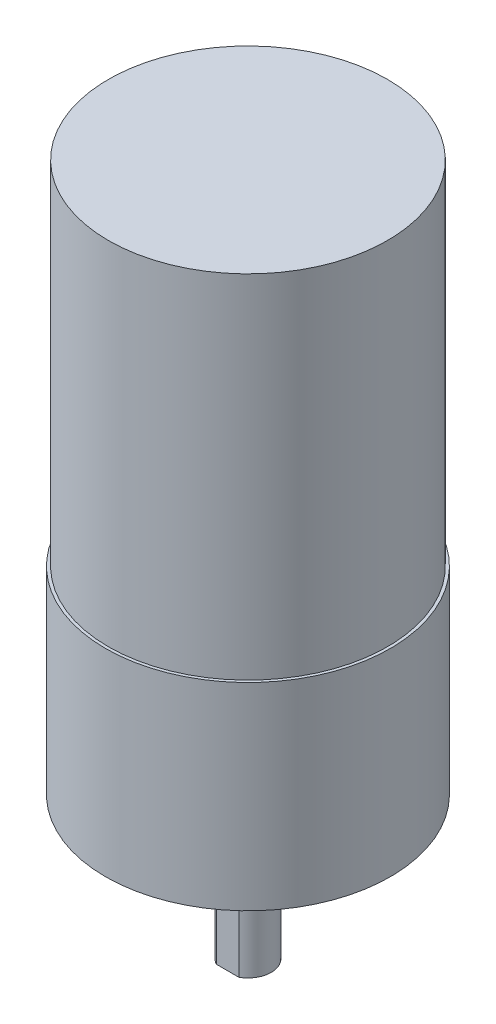
ISO-10303-21;
HEADER;
FILE_DESCRIPTION(('STEP AP214'),'2;1');
FILE_NAME('part.step','',(''),(''),'','','');
FILE_SCHEMA(('AUTOMOTIVE_DESIGN { 1 0 10303 214 1 1 1 1 }'));
ENDSEC;
DATA;
#1=APPLICATION_CONTEXT('core data for automotive mechanical design processes');
#2=APPLICATION_PROTOCOL_DEFINITION('international standard','automotive_design',2000,#1);
#3=PRODUCT_CONTEXT('',#1,'mechanical');
#4=PRODUCT('Part','Part','',(#3));
#5=PRODUCT_RELATED_PRODUCT_CATEGORY('part','',(#4));
#6=PRODUCT_DEFINITION_FORMATION('','',#4);
#7=PRODUCT_DEFINITION_CONTEXT('part definition',#1,'design');
#8=PRODUCT_DEFINITION('design','',#6,#7);
#9=PRODUCT_DEFINITION_SHAPE('','',#8);
#10=(LENGTH_UNIT() NAMED_UNIT(*) SI_UNIT(.MILLI.,.METRE.));
#11=(NAMED_UNIT(*) PLANE_ANGLE_UNIT() SI_UNIT($,.RADIAN.));
#12=(NAMED_UNIT(*) SI_UNIT($,.STERADIAN.) SOLID_ANGLE_UNIT());
#13=UNCERTAINTY_MEASURE_WITH_UNIT(LENGTH_MEASURE(1.E-05),#10,'distance_accuracy_value','');
#14=(GEOMETRIC_REPRESENTATION_CONTEXT(3) GLOBAL_UNCERTAINTY_ASSIGNED_CONTEXT((#13)) GLOBAL_UNIT_ASSIGNED_CONTEXT((#10,
#11,#12)) REPRESENTATION_CONTEXT('',''));
#15=CARTESIAN_POINT('',(0.,0.,0.));
#16=DIRECTION('',(0.,0.,1.));
#17=DIRECTION('',(1.,0.,0.));
#18=AXIS2_PLACEMENT_3D('',#15,#16,#17);
#19=CARTESIAN_POINT('',(0.,-12.446,0.));
#20=DIRECTION('',(0.,1.,0.));
#21=DIRECTION('',(0.,0.,1.));
#22=AXIS2_PLACEMENT_3D('',#19,#20,#21);
#23=CYLINDRICAL_SURFACE('',#22,2.032);
#24=CARTESIAN_POINT('',(0.,-12.446,0.));
#25=DIRECTION('',(0.,-1.,0.));
#26=DIRECTION('',(0.,0.,-1.));
#27=AXIS2_PLACEMENT_3D('',#24,#25,#26);
#28=CIRCLE('',#27,2.032);
#29=CARTESIAN_POINT('',(-0.983737769936686,-12.446,1.778));
#30=VERTEX_POINT('',#29);
#31=CARTESIAN_POINT('',(-0.983737769936686,-12.446,-1.778));
#32=VERTEX_POINT('',#31);
#33=EDGE_CURVE('E90',#30,#32,#28,.T.);
#34=ORIENTED_EDGE('',*,*,#33,.F.);
#35=DIRECTION('',(0.,1.,0.));
#36=VECTOR('',#35,1.);
#37=CARTESIAN_POINT('',(-0.983737769936686,-12.446,1.778));
#38=LINE('',#37,#36);
#39=CARTESIAN_POINT('',(-0.983737769936686,-2.54,1.778));
#40=VERTEX_POINT('',#39);
#41=EDGE_CURVE('E54',#30,#40,#38,.T.);
#42=ORIENTED_EDGE('',*,*,#41,.T.);
#43=CARTESIAN_POINT('',(0.,-2.54,0.));
#44=DIRECTION('',(0.,-1.,0.));
#45=DIRECTION('',(0.,0.,-1.));
#46=AXIS2_PLACEMENT_3D('',#43,#44,#45);
#47=CIRCLE('',#46,2.032);
#48=CARTESIAN_POINT('',(-0.983737769936686,-2.54,-1.778));
#49=VERTEX_POINT('',#48);
#50=EDGE_CURVE('E92',#40,#49,#47,.T.);
#51=ORIENTED_EDGE('',*,*,#50,.T.);
#52=DIRECTION('',(0.,1.,0.));
#53=VECTOR('',#52,1.);
#54=CARTESIAN_POINT('',(-0.983737769936686,-12.446,-1.778));
#55=LINE('',#54,#53);
#56=EDGE_CURVE('E79',#49,#32,#55,.F.);
#57=ORIENTED_EDGE('',*,*,#56,.T.);
#58=EDGE_LOOP('',(#34,#42,#51,#57));
#59=FACE_BOUND('',#58,.T.);
#60=ADVANCED_FACE('F39',(#59),#23,.T.);
#61=CARTESIAN_POINT('',(0.,17.272,0.));
#62=DIRECTION('',(0.,1.,0.));
#63=DIRECTION('',(0.,0.,1.));
#64=AXIS2_PLACEMENT_3D('',#61,#62,#63);
#65=PLANE('',#64);
#66=CARTESIAN_POINT('',(0.,17.272,0.));
#67=DIRECTION('',(0.,1.,0.));
#68=DIRECTION('',(0.,0.,1.));
#69=AXIS2_PLACEMENT_3D('',#66,#67,#68);
#70=CIRCLE('',#69,12.192);
#71=CARTESIAN_POINT('',(0.,17.272,12.192));
#72=VERTEX_POINT('',#71);
#73=EDGE_CURVE('E109',#72,#72,#70,.T.);
#74=ORIENTED_EDGE('',*,*,#73,.F.);
#75=EDGE_LOOP('',(#74));
#76=FACE_BOUND('',#75,.T.);
#77=CARTESIAN_POINT('',(0.,17.272,0.));
#78=DIRECTION('',(0.,1.,0.));
#79=DIRECTION('',(0.,0.,1.));
#80=AXIS2_PLACEMENT_3D('',#77,#78,#79);
#81=CIRCLE('',#80,12.446);
#82=CARTESIAN_POINT('',(0.,17.272,12.446));
#83=VERTEX_POINT('',#82);
#84=EDGE_CURVE('E125',#83,#83,#81,.T.);
#85=ORIENTED_EDGE('',*,*,#84,.T.);
#86=EDGE_LOOP('',(#85));
#87=FACE_BOUND('',#86,.T.);
#88=ADVANCED_FACE('F177',(#76,#87),#65,.T.);
#89=CARTESIAN_POINT('',(0.,0.,0.));
#90=DIRECTION('',(0.,1.,0.));
#91=DIRECTION('',(0.,0.,1.));
#92=AXIS2_PLACEMENT_3D('',#89,#90,#91);
#93=PLANE('',#92);
#94=CARTESIAN_POINT('',(0.,0.,0.));
#95=DIRECTION('',(0.,1.,0.));
#96=DIRECTION('',(0.,0.,1.));
#97=AXIS2_PLACEMENT_3D('',#94,#95,#96);
#98=CIRCLE('',#97,3.556);
#99=CARTESIAN_POINT('',(0.,0.,3.556));
#100=VERTEX_POINT('',#99);
#101=EDGE_CURVE('E102',#100,#100,#98,.T.);
#102=ORIENTED_EDGE('',*,*,#101,.T.);
#103=EDGE_LOOP('',(#102));
#104=FACE_BOUND('',#103,.T.);
#105=CARTESIAN_POINT('',(0.,0.,-8.11986596766364));
#106=DIRECTION('',(0.,1.,0.));
#107=DIRECTION('',(0.,0.,1.));
#108=AXIS2_PLACEMENT_3D('',#105,#106,#107);
#109=CIRCLE('',#108,1.69999999999999);
#110=CARTESIAN_POINT('',(0.,0.,-6.41986596766364));
#111=VERTEX_POINT('',#110);
#112=EDGE_CURVE('E135',#111,#111,#109,.T.);
#113=ORIENTED_EDGE('',*,*,#112,.T.);
#114=EDGE_LOOP('',(#113));
#115=FACE_BOUND('',#114,.T.);
#116=CARTESIAN_POINT('',(0.,0.,7.58703619407051));
#117=DIRECTION('',(0.,1.,0.));
#118=DIRECTION('',(0.,0.,1.));
#119=AXIS2_PLACEMENT_3D('',#116,#117,#118);
#120=CIRCLE('',#119,1.69999999999999);
#121=CARTESIAN_POINT('',(0.,0.,9.2870361940705));
#122=VERTEX_POINT('',#121);
#123=EDGE_CURVE('E147',#122,#122,#120,.T.);
#124=ORIENTED_EDGE('',*,*,#123,.T.);
#125=EDGE_LOOP('',(#124));
#126=FACE_BOUND('',#125,.T.);
#127=CARTESIAN_POINT('',(0.,0.,0.));
#128=DIRECTION('',(0.,1.,0.));
#129=DIRECTION('',(0.,0.,1.));
#130=AXIS2_PLACEMENT_3D('',#127,#128,#129);
#131=CIRCLE('',#130,12.446);
#132=CARTESIAN_POINT('',(0.,0.,12.446));
#133=VERTEX_POINT('',#132);
#134=EDGE_CURVE('E165',#133,#133,#131,.T.);
#135=ORIENTED_EDGE('',*,*,#134,.F.);
#136=EDGE_LOOP('',(#135));
#137=FACE_BOUND('',#136,.T.);
#138=CARTESIAN_POINT('',(-9.017,0.,0.));
#139=DIRECTION('',(0.,1.,0.));
#140=DIRECTION('',(0.,0.,1.));
#141=AXIS2_PLACEMENT_3D('',#138,#139,#140);
#142=CIRCLE('',#141,1.27);
#143=CARTESIAN_POINT('',(-9.017,0.,1.27));
#144=VERTEX_POINT('',#143);
#145=EDGE_CURVE('E158',#144,#144,#142,.T.);
#146=ORIENTED_EDGE('',*,*,#145,.T.);
#147=EDGE_LOOP('',(#146));
#148=FACE_BOUND('',#147,.T.);
#149=CARTESIAN_POINT('',(9.017,0.,0.));
#150=DIRECTION('',(0.,1.,0.));
#151=DIRECTION('',(0.,0.,1.));
#152=AXIS2_PLACEMENT_3D('',#149,#150,#151);
#153=CIRCLE('',#152,1.27);
#154=CARTESIAN_POINT('',(9.017,0.,1.27));
#155=VERTEX_POINT('',#154);
#156=EDGE_CURVE('E151',#155,#155,#153,.T.);
#157=ORIENTED_EDGE('',*,*,#156,.T.);
#158=EDGE_LOOP('',(#157));
#159=FACE_BOUND('',#158,.T.);
#160=ADVANCED_FACE('F174',(#104,#115,#126,#137,#148,#159),#93,.F.);
#161=CARTESIAN_POINT('',(0.,17.272,0.));
#162=DIRECTION('',(0.,-1.,0.));
#163=DIRECTION('',(0.,0.,-1.));
#164=AXIS2_PLACEMENT_3D('',#161,#162,#163);
#165=CYLINDRICAL_SURFACE('',#164,12.446);
#166=ORIENTED_EDGE('',*,*,#84,.F.);
#167=EDGE_LOOP('',(#166));
#168=FACE_BOUND('',#167,.T.);
#169=ORIENTED_EDGE('',*,*,#134,.T.);
#170=EDGE_LOOP('',(#169));
#171=FACE_BOUND('',#170,.T.);
#172=ADVANCED_FACE('F41',(#168,#171),#165,.T.);
#173=CARTESIAN_POINT('',(-9.017,17.272,0.));
#174=DIRECTION('',(0.,-1.,0.));
#175=DIRECTION('',(0.,0.,-1.));
#176=AXIS2_PLACEMENT_3D('',#173,#174,#175);
#177=CYLINDRICAL_SURFACE('',#176,1.27);
#178=CARTESIAN_POINT('',(-9.017,17.272,0.));
#179=DIRECTION('',(0.,1.,0.));
#180=DIRECTION('',(0.,0.,1.));
#181=AXIS2_PLACEMENT_3D('',#178,#179,#180);
#182=CIRCLE('',#181,1.27);
#183=CARTESIAN_POINT('',(-9.017,17.272,1.27));
#184=VERTEX_POINT('',#183);
#185=EDGE_CURVE('E143',#184,#184,#182,.T.);
#186=ORIENTED_EDGE('',*,*,#185,.T.);
#187=EDGE_LOOP('',(#186));
#188=FACE_BOUND('',#187,.T.);
#189=ORIENTED_EDGE('',*,*,#145,.F.);
#190=EDGE_LOOP('',(#189));
#191=FACE_BOUND('',#190,.T.);
#192=ADVANCED_FACE('F186',(#188,#191),#177,.F.);
#193=CARTESIAN_POINT('',(9.017,17.272,0.));
#194=DIRECTION('',(0.,-1.,0.));
#195=DIRECTION('',(0.,0.,-1.));
#196=AXIS2_PLACEMENT_3D('',#193,#194,#195);
#197=CYLINDRICAL_SURFACE('',#196,1.27);
#198=CARTESIAN_POINT('',(9.017,17.272,0.));
#199=DIRECTION('',(0.,1.,0.));
#200=DIRECTION('',(0.,0.,1.));
#201=AXIS2_PLACEMENT_3D('',#198,#199,#200);
#202=CIRCLE('',#201,1.27);
#203=CARTESIAN_POINT('',(9.017,17.272,1.27));
#204=VERTEX_POINT('',#203);
#205=EDGE_CURVE('E121',#204,#204,#202,.T.);
#206=ORIENTED_EDGE('',*,*,#205,.T.);
#207=EDGE_LOOP('',(#206));
#208=FACE_BOUND('',#207,.T.);
#209=ORIENTED_EDGE('',*,*,#156,.F.);
#210=EDGE_LOOP('',(#209));
#211=FACE_BOUND('',#210,.T.);
#212=ADVANCED_FACE('F183',(#208,#211),#197,.F.);
#213=CARTESIAN_POINT('',(0.,17.272,7.58703619407051));
#214=DIRECTION('',(0.,1.,0.));
#215=DIRECTION('',(0.,0.,1.));
#216=AXIS2_PLACEMENT_3D('',#213,#214,#215);
#217=CYLINDRICAL_SURFACE('',#216,1.7);
#218=ORIENTED_EDGE('',*,*,#123,.F.);
#219=EDGE_LOOP('',(#218));
#220=FACE_BOUND('',#219,.T.);
#221=CARTESIAN_POINT('',(0.,15.822,7.58703619407051));
#222=DIRECTION('',(0.,1.,0.));
#223=DIRECTION('',(0.,0.,1.));
#224=AXIS2_PLACEMENT_3D('',#221,#222,#223);
#225=CIRCLE('',#224,1.7);
#226=CARTESIAN_POINT('',(0.,15.822,9.28703619407051));
#227=VERTEX_POINT('',#226);
#228=EDGE_CURVE('E139',#227,#227,#225,.T.);
#229=ORIENTED_EDGE('',*,*,#228,.T.);
#230=EDGE_LOOP('',(#229));
#231=FACE_BOUND('',#230,.T.);
#232=ADVANCED_FACE('F185',(#220,#231),#217,.F.);
#233=CARTESIAN_POINT('',(0.,17.272,7.58703619407051));
#234=DIRECTION('',(0.,1.,0.));
#235=DIRECTION('',(0.,0.,1.));
#236=AXIS2_PLACEMENT_3D('',#233,#234,#235);
#237=CONICAL_SURFACE('',#236,3.15,0.785398163397449);
#238=ORIENTED_EDGE('',*,*,#228,.F.);
#239=EDGE_LOOP('',(#238));
#240=FACE_BOUND('',#239,.T.);
#241=CARTESIAN_POINT('',(0.,17.272,7.58703619407051));
#242=DIRECTION('',(0.,1.,0.));
#243=DIRECTION('',(0.,0.,1.));
#244=AXIS2_PLACEMENT_3D('',#241,#242,#243);
#245=CIRCLE('',#244,3.15);
#246=CARTESIAN_POINT('',(0.,17.272,10.7370361940705));
#247=VERTEX_POINT('',#246);
#248=EDGE_CURVE('E131',#247,#247,#245,.T.);
#249=ORIENTED_EDGE('',*,*,#248,.T.);
#250=EDGE_LOOP('',(#249));
#251=FACE_BOUND('',#250,.T.);
#252=ADVANCED_FACE('F193',(#240,#251),#237,.F.);
#253=CARTESIAN_POINT('',(0.,17.272,-8.11986596766364));
#254=DIRECTION('',(0.,1.,0.));
#255=DIRECTION('',(0.,0.,1.));
#256=AXIS2_PLACEMENT_3D('',#253,#254,#255);
#257=CYLINDRICAL_SURFACE('',#256,1.7);
#258=ORIENTED_EDGE('',*,*,#112,.F.);
#259=EDGE_LOOP('',(#258));
#260=FACE_BOUND('',#259,.T.);
#261=CARTESIAN_POINT('',(0.,15.822,-8.11986596766364));
#262=DIRECTION('',(0.,1.,0.));
#263=DIRECTION('',(0.,0.,1.));
#264=AXIS2_PLACEMENT_3D('',#261,#262,#263);
#265=CIRCLE('',#264,1.7);
#266=CARTESIAN_POINT('',(0.,15.822,-6.41986596766364));
#267=VERTEX_POINT('',#266);
#268=EDGE_CURVE('E130',#267,#267,#265,.T.);
#269=ORIENTED_EDGE('',*,*,#268,.T.);
#270=EDGE_LOOP('',(#269));
#271=FACE_BOUND('',#270,.T.);
#272=ADVANCED_FACE('F349',(#260,#271),#257,.F.);
#273=CARTESIAN_POINT('',(0.,17.272,-8.11986596766364));
#274=DIRECTION('',(0.,1.,0.));
#275=DIRECTION('',(0.,0.,1.));
#276=AXIS2_PLACEMENT_3D('',#273,#274,#275);
#277=CONICAL_SURFACE('',#276,3.15,0.785398163397449);
#278=ORIENTED_EDGE('',*,*,#268,.F.);
#279=EDGE_LOOP('',(#278));
#280=FACE_BOUND('',#279,.T.);
#281=CARTESIAN_POINT('',(0.,17.272,-8.11986596766364));
#282=DIRECTION('',(0.,1.,0.));
#283=DIRECTION('',(0.,0.,1.));
#284=AXIS2_PLACEMENT_3D('',#281,#282,#283);
#285=CIRCLE('',#284,3.15);
#286=CARTESIAN_POINT('',(0.,17.272,-4.96986596766364));
#287=VERTEX_POINT('',#286);
#288=EDGE_CURVE('E126',#287,#287,#285,.T.);
#289=ORIENTED_EDGE('',*,*,#288,.T.);
#290=EDGE_LOOP('',(#289));
#291=FACE_BOUND('',#290,.T.);
#292=ADVANCED_FACE('F334',(#280,#291),#277,.F.);
#293=CARTESIAN_POINT('',(0.,48.006,0.));
#294=DIRECTION('',(0.,1.,0.));
#295=DIRECTION('',(0.,0.,1.));
#296=AXIS2_PLACEMENT_3D('',#293,#294,#295);
#297=PLANE('',#296);
#298=CARTESIAN_POINT('',(0.,48.006,0.));
#299=DIRECTION('',(0.,1.,0.));
#300=DIRECTION('',(0.,0.,1.));
#301=AXIS2_PLACEMENT_3D('',#298,#299,#300);
#302=CIRCLE('',#301,12.192);
#303=CARTESIAN_POINT('',(0.,48.006,12.192));
#304=VERTEX_POINT('',#303);
#305=EDGE_CURVE('E114',#304,#304,#302,.T.);
#306=ORIENTED_EDGE('',*,*,#305,.T.);
#307=EDGE_LOOP('',(#306));
#308=FACE_BOUND('',#307,.T.);
#309=ADVANCED_FACE('F324',(#308),#297,.T.);
#310=CARTESIAN_POINT('',(0.,48.006,0.));
#311=DIRECTION('',(0.,-1.,0.));
#312=DIRECTION('',(0.,0.,-1.));
#313=AXIS2_PLACEMENT_3D('',#310,#311,#312);
#314=CYLINDRICAL_SURFACE('',#313,12.192);
#315=ORIENTED_EDGE('',*,*,#305,.F.);
#316=EDGE_LOOP('',(#315));
#317=FACE_BOUND('',#316,.T.);
#318=ORIENTED_EDGE('',*,*,#73,.T.);
#319=EDGE_LOOP('',(#318));
#320=FACE_BOUND('',#319,.T.);
#321=ADVANCED_FACE('F315',(#317,#320),#314,.T.);
#322=CARTESIAN_POINT('',(0.,17.272,0.));
#323=DIRECTION('',(0.,1.,0.));
#324=DIRECTION('',(0.,0.,1.));
#325=AXIS2_PLACEMENT_3D('',#322,#323,#324);
#326=PLANE('',#325);
#327=ORIENTED_EDGE('',*,*,#205,.F.);
#328=EDGE_LOOP('',(#327));
#329=FACE_BOUND('',#328,.T.);
#330=ADVANCED_FACE('F290',(#329),#326,.F.);
#331=ORIENTED_EDGE('',*,*,#185,.F.);
#332=EDGE_LOOP('',(#331));
#333=FACE_BOUND('',#332,.T.);
#334=ADVANCED_FACE('F298',(#333),#326,.F.);
#335=ORIENTED_EDGE('',*,*,#248,.F.);
#336=EDGE_LOOP('',(#335));
#337=FACE_BOUND('',#336,.T.);
#338=ADVANCED_FACE('F287',(#337),#326,.F.);
#339=ORIENTED_EDGE('',*,*,#288,.F.);
#340=EDGE_LOOP('',(#339));
#341=FACE_BOUND('',#340,.T.);
#342=ADVANCED_FACE('F268',(#341),#326,.F.);
#343=CARTESIAN_POINT('',(0.,-2.54,0.));
#344=DIRECTION('',(0.,1.,0.));
#345=DIRECTION('',(0.,0.,1.));
#346=AXIS2_PLACEMENT_3D('',#343,#344,#345);
#347=CYLINDRICAL_SURFACE('',#346,3.556);
#348=CARTESIAN_POINT('',(0.,-2.54,0.));
#349=DIRECTION('',(0.,1.,0.));
#350=DIRECTION('',(0.,0.,1.));
#351=AXIS2_PLACEMENT_3D('',#348,#349,#350);
#352=CIRCLE('',#351,3.556);
#353=CARTESIAN_POINT('',(0.,-2.54,3.556));
#354=VERTEX_POINT('',#353);
#355=EDGE_CURVE('E110',#354,#354,#352,.T.);
#356=ORIENTED_EDGE('',*,*,#355,.T.);
#357=EDGE_LOOP('',(#356));
#358=FACE_BOUND('',#357,.T.);
#359=ORIENTED_EDGE('',*,*,#101,.F.);
#360=EDGE_LOOP('',(#359));
#361=FACE_BOUND('',#360,.T.);
#362=ADVANCED_FACE('F215',(#358,#361),#347,.T.);
#363=CARTESIAN_POINT('',(0.,-2.54,0.));
#364=DIRECTION('',(0.,1.,0.));
#365=DIRECTION('',(0.,0.,1.));
#366=AXIS2_PLACEMENT_3D('',#363,#364,#365);
#367=PLANE('',#366);
#368=DIRECTION('',(1.,0.,0.));
#369=VECTOR('',#368,1.);
#370=CARTESIAN_POINT('',(1.016,-2.54,1.778));
#371=LINE('',#370,#369);
#372=CARTESIAN_POINT('',(0.983737769936686,-2.54,1.778));
#373=VERTEX_POINT('',#372);
#374=EDGE_CURVE('E94',#40,#373,#371,.T.);
#375=ORIENTED_EDGE('',*,*,#374,.T.);
#376=CARTESIAN_POINT('',(0.983737769936686,-2.54,-1.778));
#377=VERTEX_POINT('',#376);
#378=EDGE_CURVE('E86',#377,#373,#47,.T.);
#379=ORIENTED_EDGE('',*,*,#378,.F.);
#380=DIRECTION('',(-1.,0.,0.));
#381=VECTOR('',#380,1.);
#382=CARTESIAN_POINT('',(1.016,-2.54,-1.778));
#383=LINE('',#382,#381);
#384=EDGE_CURVE('E223',#377,#49,#383,.T.);
#385=ORIENTED_EDGE('',*,*,#384,.T.);
#386=ORIENTED_EDGE('',*,*,#50,.F.);
#387=EDGE_LOOP('',(#375,#379,#385,#386));
#388=FACE_BOUND('',#387,.T.);
#389=ORIENTED_EDGE('',*,*,#355,.F.);
#390=EDGE_LOOP('',(#389));
#391=FACE_BOUND('',#390,.T.);
#392=ADVANCED_FACE('F209',(#388,#391),#367,.F.);
#393=ORIENTED_EDGE('',*,*,#378,.T.);
#394=DIRECTION('',(0.,1.,0.));
#395=VECTOR('',#394,1.);
#396=CARTESIAN_POINT('',(0.983737769936686,-12.446,1.778));
#397=LINE('',#396,#395);
#398=CARTESIAN_POINT('',(0.983737769936686,-12.446,1.778));
#399=VERTEX_POINT('',#398);
#400=EDGE_CURVE('E103',#373,#399,#397,.F.);
#401=ORIENTED_EDGE('',*,*,#400,.T.);
#402=CARTESIAN_POINT('',(0.983737769936686,-12.446,-1.778));
#403=VERTEX_POINT('',#402);
#404=EDGE_CURVE('E98',#403,#399,#28,.T.);
#405=ORIENTED_EDGE('',*,*,#404,.F.);
#406=DIRECTION('',(0.,1.,0.));
#407=VECTOR('',#406,1.);
#408=CARTESIAN_POINT('',(0.983737769936686,-12.446,-1.778));
#409=LINE('',#408,#407);
#410=EDGE_CURVE('E62',#403,#377,#409,.T.);
#411=ORIENTED_EDGE('',*,*,#410,.T.);
#412=EDGE_LOOP('',(#393,#401,#405,#411));
#413=FACE_BOUND('',#412,.T.);
#414=ADVANCED_FACE('F200',(#413),#23,.T.);
#415=CARTESIAN_POINT('',(0.,-12.446,0.));
#416=DIRECTION('',(0.,-1.,0.));
#417=DIRECTION('',(0.,0.,-1.));
#418=AXIS2_PLACEMENT_3D('',#415,#416,#417);
#419=PLANE('',#418);
#420=DIRECTION('',(1.,0.,0.));
#421=VECTOR('',#420,1.);
#422=CARTESIAN_POINT('',(0.,-12.446,1.778));
#423=LINE('',#422,#421);
#424=EDGE_CURVE('E11',#30,#399,#423,.T.);
#425=ORIENTED_EDGE('',*,*,#424,.F.);
#426=ORIENTED_EDGE('',*,*,#33,.T.);
#427=DIRECTION('',(-1.,0.,0.));
#428=VECTOR('',#427,1.);
#429=CARTESIAN_POINT('',(0.,-12.446,-1.778));
#430=LINE('',#429,#428);
#431=EDGE_CURVE('E48',#403,#32,#430,.T.);
#432=ORIENTED_EDGE('',*,*,#431,.F.);
#433=ORIENTED_EDGE('',*,*,#404,.T.);
#434=EDGE_LOOP('',(#425,#426,#432,#433));
#435=FACE_BOUND('',#434,.T.);
#436=ADVANCED_FACE('F96',(#435),#419,.T.);
#437=CARTESIAN_POINT('',(1.016,-2.54,-1.778));
#438=DIRECTION('',(0.,0.,1.));
#439=DIRECTION('',(1.,0.,0.));
#440=AXIS2_PLACEMENT_3D('',#437,#438,#439);
#441=PLANE('',#440);
#442=ORIENTED_EDGE('',*,*,#431,.T.);
#443=ORIENTED_EDGE('',*,*,#56,.F.);
#444=ORIENTED_EDGE('',*,*,#384,.F.);
#445=ORIENTED_EDGE('',*,*,#410,.F.);
#446=EDGE_LOOP('',(#442,#443,#444,#445));
#447=FACE_BOUND('',#446,.T.);
#448=ADVANCED_FACE('F78',(#447),#441,.F.);
#449=CARTESIAN_POINT('',(1.016,-2.54,1.778));
#450=DIRECTION('',(0.,0.,-1.));
#451=DIRECTION('',(-1.,0.,0.));
#452=AXIS2_PLACEMENT_3D('',#449,#450,#451);
#453=PLANE('',#452);
#454=ORIENTED_EDGE('',*,*,#424,.T.);
#455=ORIENTED_EDGE('',*,*,#400,.F.);
#456=ORIENTED_EDGE('',*,*,#374,.F.);
#457=ORIENTED_EDGE('',*,*,#41,.F.);
#458=EDGE_LOOP('',(#454,#455,#456,#457));
#459=FACE_BOUND('',#458,.T.);
#460=ADVANCED_FACE('F231',(#459),#453,.F.);
#461=CLOSED_SHELL('',(#60,#88,#160,#172,#192,#212,#232,#252,#272,#292,#309,#321,#330,#334,#338,
#342,#362,#392,#414,#436,#448,#460));
#462=MANIFOLD_SOLID_BREP('B2',#461);
#463=ADVANCED_BREP_SHAPE_REPRESENTATION('',(#18,#462),#14);
#464=SHAPE_DEFINITION_REPRESENTATION(#9,#463);
ENDSEC;
END-ISO-10303-21;
